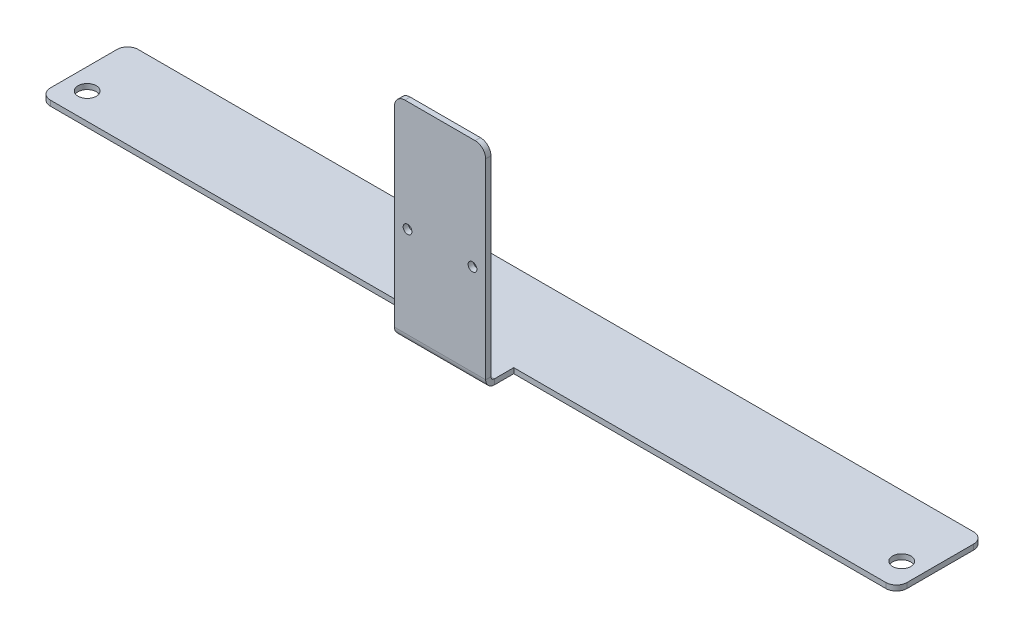
ISO-10303-21;
HEADER;
FILE_DESCRIPTION(('STEP AP214'),'2;1');
FILE_NAME('part.step','',(''),(''),'','','');
FILE_SCHEMA(('AUTOMOTIVE_DESIGN { 1 0 10303 214 1 1 1 1 }'));
ENDSEC;
DATA;
#1=APPLICATION_CONTEXT('core data for automotive mechanical design processes');
#2=APPLICATION_PROTOCOL_DEFINITION('international standard','automotive_design',2000,#1);
#3=PRODUCT_CONTEXT('',#1,'mechanical');
#4=PRODUCT('Part','Part','',(#3));
#5=PRODUCT_RELATED_PRODUCT_CATEGORY('part','',(#4));
#6=PRODUCT_DEFINITION_FORMATION('','',#4);
#7=PRODUCT_DEFINITION_CONTEXT('part definition',#1,'design');
#8=PRODUCT_DEFINITION('design','',#6,#7);
#9=PRODUCT_DEFINITION_SHAPE('','',#8);
#10=(LENGTH_UNIT() NAMED_UNIT(*) SI_UNIT(.MILLI.,.METRE.));
#11=(NAMED_UNIT(*) PLANE_ANGLE_UNIT() SI_UNIT($,.RADIAN.));
#12=(NAMED_UNIT(*) SI_UNIT($,.STERADIAN.) SOLID_ANGLE_UNIT());
#13=UNCERTAINTY_MEASURE_WITH_UNIT(LENGTH_MEASURE(1.E-05),#10,'distance_accuracy_value','');
#14=(GEOMETRIC_REPRESENTATION_CONTEXT(3) GLOBAL_UNCERTAINTY_ASSIGNED_CONTEXT((#13)) GLOBAL_UNIT_ASSIGNED_CONTEXT((#10,
#11,#12)) REPRESENTATION_CONTEXT('',''));
#15=CARTESIAN_POINT('',(0.,0.,0.));
#16=DIRECTION('',(0.,0.,1.));
#17=DIRECTION('',(1.,0.,0.));
#18=AXIS2_PLACEMENT_3D('',#15,#16,#17);
#19=CARTESIAN_POINT('',(-122.,-1.5,12.5));
#20=DIRECTION('',(0.,0.,1.));
#21=DIRECTION('',(1.,0.,0.));
#22=AXIS2_PLACEMENT_3D('',#19,#20,#21);
#23=PLANE('',#22);
#24=DIRECTION('',(1.,0.,0.));
#25=VECTOR('',#24,1.);
#26=CARTESIAN_POINT('',(-122.,-1.5,12.5));
#27=LINE('',#26,#25);
#28=CARTESIAN_POINT('',(12.9999999999999,-1.5,12.5));
#29=VERTEX_POINT('',#28);
#30=CARTESIAN_POINT('',(119.,-1.5,12.5));
#31=VERTEX_POINT('',#30);
#32=EDGE_CURVE('E279',#29,#31,#27,.T.);
#33=ORIENTED_EDGE('',*,*,#32,.T.);
#34=DIRECTION('',(0.,1.,0.));
#35=VECTOR('',#34,1.);
#36=CARTESIAN_POINT('',(119.,-1.5,12.5));
#37=LINE('',#36,#35);
#38=CARTESIAN_POINT('',(119.,0.,12.5));
#39=VERTEX_POINT('',#38);
#40=EDGE_CURVE('E304',#31,#39,#37,.T.);
#41=ORIENTED_EDGE('',*,*,#40,.T.);
#42=DIRECTION('',(1.,0.,0.));
#43=VECTOR('',#42,1.);
#44=CARTESIAN_POINT('',(-122.,0.,12.5));
#45=LINE('',#44,#43);
#46=CARTESIAN_POINT('',(13.,0.,12.5));
#47=VERTEX_POINT('',#46);
#48=EDGE_CURVE('E269',#47,#39,#45,.T.);
#49=ORIENTED_EDGE('',*,*,#48,.F.);
#50=DIRECTION('',(0.,-1.,0.));
#51=VECTOR('',#50,1.);
#52=CARTESIAN_POINT('',(13.,0.,12.5));
#53=LINE('',#52,#51);
#54=EDGE_CURVE('E248',#47,#29,#53,.T.);
#55=ORIENTED_EDGE('',*,*,#54,.T.);
#56=EDGE_LOOP('',(#33,#41,#49,#55));
#57=FACE_BOUND('',#56,.T.);
#58=ADVANCED_FACE('F58',(#57),#23,.T.);
#59=CARTESIAN_POINT('',(122.,-1.5,12.5));
#60=DIRECTION('',(1.,0.,0.));
#61=DIRECTION('',(0.,0.,-1.));
#62=AXIS2_PLACEMENT_3D('',#59,#60,#61);
#63=PLANE('',#62);
#64=DIRECTION('',(0.,0.,-1.));
#65=VECTOR('',#64,1.);
#66=CARTESIAN_POINT('',(122.,-1.5,12.5));
#67=LINE('',#66,#65);
#68=CARTESIAN_POINT('',(122.,-1.5,9.5));
#69=VERTEX_POINT('',#68);
#70=CARTESIAN_POINT('',(122.,-1.5,-9.5));
#71=VERTEX_POINT('',#70);
#72=EDGE_CURVE('E268',#69,#71,#67,.T.);
#73=ORIENTED_EDGE('',*,*,#72,.T.);
#74=DIRECTION('',(0.,1.,0.));
#75=VECTOR('',#74,1.);
#76=CARTESIAN_POINT('',(122.,-1.5,-9.5));
#77=LINE('',#76,#75);
#78=CARTESIAN_POINT('',(122.,0.,-9.5));
#79=VERTEX_POINT('',#78);
#80=EDGE_CURVE('E260',#71,#79,#77,.T.);
#81=ORIENTED_EDGE('',*,*,#80,.T.);
#82=DIRECTION('',(0.,0.,-1.));
#83=VECTOR('',#82,1.);
#84=CARTESIAN_POINT('',(122.,0.,12.5));
#85=LINE('',#84,#83);
#86=CARTESIAN_POINT('',(122.,0.,9.5));
#87=VERTEX_POINT('',#86);
#88=EDGE_CURVE('E289',#87,#79,#85,.T.);
#89=ORIENTED_EDGE('',*,*,#88,.F.);
#90=DIRECTION('',(0.,1.,0.));
#91=VECTOR('',#90,1.);
#92=CARTESIAN_POINT('',(122.,-1.5,9.5));
#93=LINE('',#92,#91);
#94=EDGE_CURVE('E258',#87,#69,#93,.F.);
#95=ORIENTED_EDGE('',*,*,#94,.T.);
#96=EDGE_LOOP('',(#73,#81,#89,#95));
#97=FACE_BOUND('',#96,.T.);
#98=ADVANCED_FACE('F377',(#97),#63,.T.);
#99=CARTESIAN_POINT('',(-119.,0.,12.5));
#100=VERTEX_POINT('',#99);
#101=CARTESIAN_POINT('',(-13.,0.,12.5));
#102=VERTEX_POINT('',#101);
#103=EDGE_CURVE('E265',#100,#102,#45,.T.);
#104=ORIENTED_EDGE('',*,*,#103,.F.);
#105=DIRECTION('',(0.,1.,0.));
#106=VECTOR('',#105,1.);
#107=CARTESIAN_POINT('',(-119.,-1.5,12.5));
#108=LINE('',#107,#106);
#109=CARTESIAN_POINT('',(-119.,-1.5,12.5));
#110=VERTEX_POINT('',#109);
#111=EDGE_CURVE('E13',#100,#110,#108,.F.);
#112=ORIENTED_EDGE('',*,*,#111,.T.);
#113=CARTESIAN_POINT('',(-13.,-1.5,12.5));
#114=VERTEX_POINT('',#113);
#115=EDGE_CURVE('E261',#110,#114,#27,.T.);
#116=ORIENTED_EDGE('',*,*,#115,.T.);
#117=DIRECTION('',(0.,-1.,0.));
#118=VECTOR('',#117,1.);
#119=CARTESIAN_POINT('',(-13.,0.,12.5));
#120=LINE('',#119,#118);
#121=EDGE_CURVE('E237',#102,#114,#120,.T.);
#122=ORIENTED_EDGE('',*,*,#121,.F.);
#123=EDGE_LOOP('',(#104,#112,#116,#122));
#124=FACE_BOUND('',#123,.T.);
#125=ADVANCED_FACE('F401',(#124),#23,.T.);
#126=CARTESIAN_POINT('',(-122.,-1.5,12.5));
#127=DIRECTION('',(-1.,0.,0.));
#128=DIRECTION('',(0.,0.,1.));
#129=AXIS2_PLACEMENT_3D('',#126,#127,#128);
#130=PLANE('',#129);
#131=DIRECTION('',(0.,0.,1.));
#132=VECTOR('',#131,1.);
#133=CARTESIAN_POINT('',(-122.,-1.5,12.5));
#134=LINE('',#133,#132);
#135=CARTESIAN_POINT('',(-122.,-1.5,-9.5));
#136=VERTEX_POINT('',#135);
#137=CARTESIAN_POINT('',(-122.,-1.5,9.5));
#138=VERTEX_POINT('',#137);
#139=EDGE_CURVE('E283',#136,#138,#134,.T.);
#140=ORIENTED_EDGE('',*,*,#139,.T.);
#141=DIRECTION('',(0.,1.,0.));
#142=VECTOR('',#141,1.);
#143=CARTESIAN_POINT('',(-122.,-1.5,9.5));
#144=LINE('',#143,#142);
#145=CARTESIAN_POINT('',(-122.,0.,9.5));
#146=VERTEX_POINT('',#145);
#147=EDGE_CURVE('E66',#138,#146,#144,.T.);
#148=ORIENTED_EDGE('',*,*,#147,.T.);
#149=DIRECTION('',(0.,0.,1.));
#150=VECTOR('',#149,1.);
#151=CARTESIAN_POINT('',(-122.,0.,12.5));
#152=LINE('',#151,#150);
#153=CARTESIAN_POINT('',(-122.,0.,-9.5));
#154=VERTEX_POINT('',#153);
#155=EDGE_CURVE('E274',#154,#146,#152,.T.);
#156=ORIENTED_EDGE('',*,*,#155,.F.);
#157=DIRECTION('',(0.,1.,0.));
#158=VECTOR('',#157,1.);
#159=CARTESIAN_POINT('',(-122.,-1.5,-9.5));
#160=LINE('',#159,#158);
#161=EDGE_CURVE('E323',#154,#136,#160,.F.);
#162=ORIENTED_EDGE('',*,*,#161,.T.);
#163=EDGE_LOOP('',(#140,#148,#156,#162));
#164=FACE_BOUND('',#163,.T.);
#165=ADVANCED_FACE('F330',(#164),#130,.T.);
#166=CARTESIAN_POINT('',(-122.,-1.5,-12.5));
#167=DIRECTION('',(0.,0.,-1.));
#168=DIRECTION('',(-1.,0.,0.));
#169=AXIS2_PLACEMENT_3D('',#166,#167,#168);
#170=PLANE('',#169);
#171=DIRECTION('',(-1.,0.,0.));
#172=VECTOR('',#171,1.);
#173=CARTESIAN_POINT('',(-122.,0.,-12.5));
#174=LINE('',#173,#172);
#175=CARTESIAN_POINT('',(119.,0.,-12.5));
#176=VERTEX_POINT('',#175);
#177=CARTESIAN_POINT('',(-119.,0.,-12.5));
#178=VERTEX_POINT('',#177);
#179=EDGE_CURVE('E341',#176,#178,#174,.T.);
#180=ORIENTED_EDGE('',*,*,#179,.F.);
#181=DIRECTION('',(0.,1.,0.));
#182=VECTOR('',#181,1.);
#183=CARTESIAN_POINT('',(119.,-1.5,-12.5));
#184=LINE('',#183,#182);
#185=CARTESIAN_POINT('',(119.,-1.5,-12.5));
#186=VERTEX_POINT('',#185);
#187=EDGE_CURVE('E294',#176,#186,#184,.F.);
#188=ORIENTED_EDGE('',*,*,#187,.T.);
#189=DIRECTION('',(-1.,0.,0.));
#190=VECTOR('',#189,1.);
#191=CARTESIAN_POINT('',(-122.,-1.5,-12.5));
#192=LINE('',#191,#190);
#193=CARTESIAN_POINT('',(-119.,-1.5,-12.5));
#194=VERTEX_POINT('',#193);
#195=EDGE_CURVE('E390',#186,#194,#192,.T.);
#196=ORIENTED_EDGE('',*,*,#195,.T.);
#197=DIRECTION('',(0.,1.,0.));
#198=VECTOR('',#197,1.);
#199=CARTESIAN_POINT('',(-119.,-1.5,-12.5));
#200=LINE('',#199,#198);
#201=EDGE_CURVE('E383',#194,#178,#200,.T.);
#202=ORIENTED_EDGE('',*,*,#201,.T.);
#203=EDGE_LOOP('',(#180,#188,#196,#202));
#204=FACE_BOUND('',#203,.T.);
#205=ADVANCED_FACE('F389',(#204),#170,.T.);
#206=CARTESIAN_POINT('',(0.,-1.5,0.));
#207=DIRECTION('',(0.,-1.,0.));
#208=DIRECTION('',(0.,0.,-1.));
#209=AXIS2_PLACEMENT_3D('',#206,#207,#208);
#210=PLANE('',#209);
#211=CARTESIAN_POINT('',(-116.,-1.5,5.));
#212=DIRECTION('',(0.,-1.,0.));
#213=DIRECTION('',(0.,0.,-1.));
#214=AXIS2_PLACEMENT_3D('',#211,#212,#213);
#215=CIRCLE('',#214,2.6);
#216=CARTESIAN_POINT('',(-116.,-1.5,2.4));
#217=VERTEX_POINT('',#216);
#218=EDGE_CURVE('E523',#217,#217,#215,.T.);
#219=ORIENTED_EDGE('',*,*,#218,.F.);
#220=EDGE_LOOP('',(#219));
#221=FACE_BOUND('',#220,.T.);
#222=CARTESIAN_POINT('',(116.,-1.5,5.00000000000003));
#223=DIRECTION('',(0.,-1.,0.));
#224=DIRECTION('',(0.,0.,-1.));
#225=AXIS2_PLACEMENT_3D('',#222,#223,#224);
#226=CIRCLE('',#225,2.6);
#227=CARTESIAN_POINT('',(116.,-1.5,2.40000000000003));
#228=VERTEX_POINT('',#227);
#229=EDGE_CURVE('E443',#228,#228,#226,.T.);
#230=ORIENTED_EDGE('',*,*,#229,.F.);
#231=EDGE_LOOP('',(#230));
#232=FACE_BOUND('',#231,.T.);
#233=ORIENTED_EDGE('',*,*,#195,.F.);
#234=CARTESIAN_POINT('',(119.,-1.5,-9.5));
#235=DIRECTION('',(0.,-1.,0.));
#236=DIRECTION('',(0.,0.,-1.));
#237=AXIS2_PLACEMENT_3D('',#234,#235,#236);
#238=CIRCLE('',#237,3.);
#239=EDGE_CURVE('E302',#186,#71,#238,.T.);
#240=ORIENTED_EDGE('',*,*,#239,.T.);
#241=ORIENTED_EDGE('',*,*,#72,.F.);
#242=CARTESIAN_POINT('',(119.,-1.5,9.5));
#243=DIRECTION('',(0.,-1.,0.));
#244=DIRECTION('',(0.,0.,-1.));
#245=AXIS2_PLACEMENT_3D('',#242,#243,#244);
#246=CIRCLE('',#245,3.);
#247=EDGE_CURVE('E300',#69,#31,#246,.T.);
#248=ORIENTED_EDGE('',*,*,#247,.T.);
#249=ORIENTED_EDGE('',*,*,#32,.F.);
#250=DIRECTION('',(0.,0.,-1.));
#251=VECTOR('',#250,1.);
#252=CARTESIAN_POINT('',(13.,-1.5,18.));
#253=LINE('',#252,#251);
#254=CARTESIAN_POINT('',(13.,-1.5,18.));
#255=VERTEX_POINT('',#254);
#256=EDGE_CURVE('E254',#255,#29,#253,.T.);
#257=ORIENTED_EDGE('',*,*,#256,.F.);
#258=DIRECTION('',(1.,0.,0.));
#259=VECTOR('',#258,1.);
#260=CARTESIAN_POINT('',(13.,-1.5,18.));
#261=LINE('',#260,#259);
#262=CARTESIAN_POINT('',(-13.,-1.5,18.));
#263=VERTEX_POINT('',#262);
#264=EDGE_CURVE('E200',#255,#263,#261,.F.);
#265=ORIENTED_EDGE('',*,*,#264,.T.);
#266=DIRECTION('',(0.,0.,-1.));
#267=VECTOR('',#266,1.);
#268=CARTESIAN_POINT('',(-13.,-1.5,18.));
#269=LINE('',#268,#267);
#270=EDGE_CURVE('E251',#263,#114,#269,.T.);
#271=ORIENTED_EDGE('',*,*,#270,.T.);
#272=ORIENTED_EDGE('',*,*,#115,.F.);
#273=CARTESIAN_POINT('',(-119.,-1.5,9.5));
#274=DIRECTION('',(0.,-1.,0.));
#275=DIRECTION('',(0.,0.,-1.));
#276=AXIS2_PLACEMENT_3D('',#273,#274,#275);
#277=CIRCLE('',#276,3.);
#278=EDGE_CURVE('E298',#110,#138,#277,.T.);
#279=ORIENTED_EDGE('',*,*,#278,.T.);
#280=ORIENTED_EDGE('',*,*,#139,.F.);
#281=CARTESIAN_POINT('',(-119.,-1.5,-9.5));
#282=DIRECTION('',(0.,-1.,0.));
#283=DIRECTION('',(0.,0.,-1.));
#284=AXIS2_PLACEMENT_3D('',#281,#282,#283);
#285=CIRCLE('',#284,3.);
#286=EDGE_CURVE('E296',#136,#194,#285,.T.);
#287=ORIENTED_EDGE('',*,*,#286,.T.);
#288=EDGE_LOOP('',(#233,#240,#241,#248,#249,#257,#265,#271,#272,#279,#280,#287));
#289=FACE_BOUND('',#288,.T.);
#290=ADVANCED_FACE('F366',(#221,#232,#289),#210,.T.);
#291=CARTESIAN_POINT('',(0.,0.,0.));
#292=DIRECTION('',(0.,-1.,0.));
#293=DIRECTION('',(0.,0.,-1.));
#294=AXIS2_PLACEMENT_3D('',#291,#292,#293);
#295=PLANE('',#294);
#296=CARTESIAN_POINT('',(-116.,0.,5.));
#297=DIRECTION('',(0.,-1.,0.));
#298=DIRECTION('',(0.,0.,-1.));
#299=AXIS2_PLACEMENT_3D('',#296,#297,#298);
#300=CIRCLE('',#299,2.6);
#301=CARTESIAN_POINT('',(-116.,0.,2.4));
#302=VERTEX_POINT('',#301);
#303=EDGE_CURVE('E439',#302,#302,#300,.T.);
#304=ORIENTED_EDGE('',*,*,#303,.T.);
#305=EDGE_LOOP('',(#304));
#306=FACE_BOUND('',#305,.T.);
#307=CARTESIAN_POINT('',(116.,0.,5.00000000000003));
#308=DIRECTION('',(0.,-1.,0.));
#309=DIRECTION('',(0.,0.,-1.));
#310=AXIS2_PLACEMENT_3D('',#307,#308,#309);
#311=CIRCLE('',#310,2.6);
#312=CARTESIAN_POINT('',(116.,0.,2.40000000000003));
#313=VERTEX_POINT('',#312);
#314=EDGE_CURVE('E224',#313,#313,#311,.T.);
#315=ORIENTED_EDGE('',*,*,#314,.T.);
#316=EDGE_LOOP('',(#315));
#317=FACE_BOUND('',#316,.T.);
#318=ORIENTED_EDGE('',*,*,#88,.T.);
#319=CARTESIAN_POINT('',(119.,0.,-9.5));
#320=DIRECTION('',(0.,-1.,0.));
#321=DIRECTION('',(0.,0.,-1.));
#322=AXIS2_PLACEMENT_3D('',#319,#320,#321);
#323=CIRCLE('',#322,3.);
#324=EDGE_CURVE('E374',#79,#176,#323,.F.);
#325=ORIENTED_EDGE('',*,*,#324,.T.);
#326=ORIENTED_EDGE('',*,*,#179,.T.);
#327=CARTESIAN_POINT('',(-119.,0.,-9.5));
#328=DIRECTION('',(0.,-1.,0.));
#329=DIRECTION('',(0.,0.,-1.));
#330=AXIS2_PLACEMENT_3D('',#327,#328,#329);
#331=CIRCLE('',#330,3.);
#332=EDGE_CURVE('E264',#178,#154,#331,.F.);
#333=ORIENTED_EDGE('',*,*,#332,.T.);
#334=ORIENTED_EDGE('',*,*,#155,.T.);
#335=CARTESIAN_POINT('',(-119.,0.,9.5));
#336=DIRECTION('',(0.,-1.,0.));
#337=DIRECTION('',(0.,0.,-1.));
#338=AXIS2_PLACEMENT_3D('',#335,#336,#337);
#339=CIRCLE('',#338,3.);
#340=EDGE_CURVE('E338',#146,#100,#339,.F.);
#341=ORIENTED_EDGE('',*,*,#340,.T.);
#342=ORIENTED_EDGE('',*,*,#103,.T.);
#343=DIRECTION('',(0.,0.,-1.));
#344=VECTOR('',#343,1.);
#345=CARTESIAN_POINT('',(-13.,0.,18.));
#346=LINE('',#345,#344);
#347=CARTESIAN_POINT('',(-13.,0.,18.));
#348=VERTEX_POINT('',#347);
#349=EDGE_CURVE('E255',#348,#102,#346,.T.);
#350=ORIENTED_EDGE('',*,*,#349,.F.);
#351=DIRECTION('',(1.,0.,0.));
#352=VECTOR('',#351,1.);
#353=CARTESIAN_POINT('',(13.,0.,18.));
#354=LINE('',#353,#352);
#355=CARTESIAN_POINT('',(13.,0.,18.));
#356=VERTEX_POINT('',#355);
#357=EDGE_CURVE('E231',#356,#348,#354,.F.);
#358=ORIENTED_EDGE('',*,*,#357,.F.);
#359=DIRECTION('',(0.,0.,-1.));
#360=VECTOR('',#359,1.);
#361=CARTESIAN_POINT('',(13.,0.,18.));
#362=LINE('',#361,#360);
#363=EDGE_CURVE('E343',#356,#47,#362,.T.);
#364=ORIENTED_EDGE('',*,*,#363,.T.);
#365=ORIENTED_EDGE('',*,*,#48,.T.);
#366=CARTESIAN_POINT('',(119.,0.,9.5));
#367=DIRECTION('',(0.,-1.,0.));
#368=DIRECTION('',(0.,0.,-1.));
#369=AXIS2_PLACEMENT_3D('',#366,#367,#368);
#370=CIRCLE('',#369,3.);
#371=EDGE_CURVE('E373',#39,#87,#370,.F.);
#372=ORIENTED_EDGE('',*,*,#371,.T.);
#373=EDGE_LOOP('',(#318,#325,#326,#333,#334,#341,#342,#350,#358,#364,#365,#372));
#374=FACE_BOUND('',#373,.T.);
#375=ADVANCED_FACE('F337',(#306,#317,#374),#295,.F.);
#376=CARTESIAN_POINT('',(13.,0.,18.));
#377=DIRECTION('',(1.,0.,0.));
#378=DIRECTION('',(0.,-1.,0.));
#379=AXIS2_PLACEMENT_3D('',#376,#377,#378);
#380=PLANE('',#379);
#381=ORIENTED_EDGE('',*,*,#363,.F.);
#382=DIRECTION('',(0.,-1.,0.));
#383=VECTOR('',#382,1.);
#384=CARTESIAN_POINT('',(13.,0.,18.));
#385=LINE('',#384,#383);
#386=EDGE_CURVE('E227',#356,#255,#385,.T.);
#387=ORIENTED_EDGE('',*,*,#386,.T.);
#388=ORIENTED_EDGE('',*,*,#256,.T.);
#389=ORIENTED_EDGE('',*,*,#54,.F.);
#390=EDGE_LOOP('',(#381,#387,#388,#389));
#391=FACE_BOUND('',#390,.T.);
#392=ADVANCED_FACE('F419',(#391),#380,.T.);
#393=CARTESIAN_POINT('',(-13.,0.,18.));
#394=DIRECTION('',(1.,0.,0.));
#395=DIRECTION('',(0.,-1.,0.));
#396=AXIS2_PLACEMENT_3D('',#393,#394,#395);
#397=PLANE('',#396);
#398=ORIENTED_EDGE('',*,*,#270,.F.);
#399=DIRECTION('',(0.,-1.,0.));
#400=VECTOR('',#399,1.);
#401=CARTESIAN_POINT('',(-13.,0.,18.));
#402=LINE('',#401,#400);
#403=EDGE_CURVE('E234',#348,#263,#402,.T.);
#404=ORIENTED_EDGE('',*,*,#403,.F.);
#405=ORIENTED_EDGE('',*,*,#349,.T.);
#406=ORIENTED_EDGE('',*,*,#121,.T.);
#407=EDGE_LOOP('',(#398,#404,#405,#406));
#408=FACE_BOUND('',#407,.T.);
#409=ADVANCED_FACE('F416',(#408),#397,.F.);
#410=CARTESIAN_POINT('',(-13.,1.,18.));
#411=DIRECTION('',(-1.,0.,0.));
#412=DIRECTION('',(0.,-1.,0.));
#413=AXIS2_PLACEMENT_3D('',#410,#411,#412);
#414=PLANE('',#413);
#415=DIRECTION('',(0.,0.,1.));
#416=VECTOR('',#415,1.);
#417=CARTESIAN_POINT('',(-13.,1.,20.5000000000002));
#418=LINE('',#417,#416);
#419=CARTESIAN_POINT('',(-13.,0.999999999999999,19.));
#420=VERTEX_POINT('',#419);
#421=CARTESIAN_POINT('',(-13.,0.999999999999993,20.5));
#422=VERTEX_POINT('',#421);
#423=EDGE_CURVE('E221',#420,#422,#418,.T.);
#424=ORIENTED_EDGE('',*,*,#423,.F.);
#425=CARTESIAN_POINT('',(-13.,1.,18.));
#426=DIRECTION('',(1.,0.,0.));
#427=DIRECTION('',(0.,1.,0.));
#428=AXIS2_PLACEMENT_3D('',#425,#426,#427);
#429=CIRCLE('',#428,1.);
#430=EDGE_CURVE('E203',#348,#420,#429,.F.);
#431=ORIENTED_EDGE('',*,*,#430,.F.);
#432=ORIENTED_EDGE('',*,*,#403,.T.);
#433=CARTESIAN_POINT('',(-13.,1.,18.));
#434=DIRECTION('',(1.,0.,0.));
#435=DIRECTION('',(0.,1.,0.));
#436=AXIS2_PLACEMENT_3D('',#433,#434,#435);
#437=CIRCLE('',#436,2.5);
#438=EDGE_CURVE('E226',#263,#422,#437,.F.);
#439=ORIENTED_EDGE('',*,*,#438,.T.);
#440=EDGE_LOOP('',(#424,#431,#432,#439));
#441=FACE_BOUND('',#440,.T.);
#442=ADVANCED_FACE('F418',(#441),#414,.T.);
#443=CARTESIAN_POINT('',(13.,0.999999999999996,18.));
#444=DIRECTION('',(-1.,0.,0.));
#445=DIRECTION('',(0.,-1.,0.));
#446=AXIS2_PLACEMENT_3D('',#443,#444,#445);
#447=PLANE('',#446);
#448=CARTESIAN_POINT('',(13.,0.999999999999996,18.));
#449=DIRECTION('',(1.,0.,0.));
#450=DIRECTION('',(0.,1.,0.));
#451=AXIS2_PLACEMENT_3D('',#448,#449,#450);
#452=CIRCLE('',#451,1.);
#453=CARTESIAN_POINT('',(13.,0.999999999999993,19.));
#454=VERTEX_POINT('',#453);
#455=EDGE_CURVE('E190',#454,#356,#452,.T.);
#456=ORIENTED_EDGE('',*,*,#455,.F.);
#457=DIRECTION('',(0.,0.,1.));
#458=VECTOR('',#457,1.);
#459=CARTESIAN_POINT('',(13.,0.999999999999997,19.));
#460=LINE('',#459,#458);
#461=CARTESIAN_POINT('',(13.,0.999999999999997,20.5));
#462=VERTEX_POINT('',#461);
#463=EDGE_CURVE('E187',#454,#462,#460,.T.);
#464=ORIENTED_EDGE('',*,*,#463,.T.);
#465=CARTESIAN_POINT('',(13.,0.999999999999996,18.));
#466=DIRECTION('',(1.,0.,0.));
#467=DIRECTION('',(0.,1.,0.));
#468=AXIS2_PLACEMENT_3D('',#465,#466,#467);
#469=CIRCLE('',#468,2.5);
#470=EDGE_CURVE('E195',#462,#255,#469,.T.);
#471=ORIENTED_EDGE('',*,*,#470,.T.);
#472=ORIENTED_EDGE('',*,*,#386,.F.);
#473=EDGE_LOOP('',(#456,#464,#471,#472));
#474=FACE_BOUND('',#473,.T.);
#475=ADVANCED_FACE('F206',(#474),#447,.F.);
#476=CARTESIAN_POINT('',(13.,0.999999999999996,18.));
#477=DIRECTION('',(1.,0.,0.));
#478=DIRECTION('',(0.,0.,1.));
#479=AXIS2_PLACEMENT_3D('',#476,#477,#478);
#480=CYLINDRICAL_SURFACE('',#479,2.5);
#481=ORIENTED_EDGE('',*,*,#264,.F.);
#482=ORIENTED_EDGE('',*,*,#470,.F.);
#483=DIRECTION('',(1.,0.,0.));
#484=VECTOR('',#483,1.);
#485=CARTESIAN_POINT('',(0.,0.999999999999999,20.5));
#486=LINE('',#485,#484);
#487=EDGE_CURVE('E197',#422,#462,#486,.T.);
#488=ORIENTED_EDGE('',*,*,#487,.F.);
#489=ORIENTED_EDGE('',*,*,#438,.F.);
#490=EDGE_LOOP('',(#481,#482,#488,#489));
#491=FACE_BOUND('',#490,.T.);
#492=ADVANCED_FACE('F196',(#491),#480,.T.);
#493=CARTESIAN_POINT('',(13.,0.999999999999996,18.));
#494=DIRECTION('',(1.,0.,0.));
#495=DIRECTION('',(0.,0.,1.));
#496=AXIS2_PLACEMENT_3D('',#493,#494,#495);
#497=CYLINDRICAL_SURFACE('',#496,1.);
#498=ORIENTED_EDGE('',*,*,#357,.T.);
#499=ORIENTED_EDGE('',*,*,#430,.T.);
#500=DIRECTION('',(-1.,0.,0.));
#501=VECTOR('',#500,1.);
#502=CARTESIAN_POINT('',(-13.,1.,19.));
#503=LINE('',#502,#501);
#504=EDGE_CURVE('E208',#420,#454,#503,.F.);
#505=ORIENTED_EDGE('',*,*,#504,.T.);
#506=ORIENTED_EDGE('',*,*,#455,.T.);
#507=EDGE_LOOP('',(#498,#499,#505,#506));
#508=FACE_BOUND('',#507,.T.);
#509=ADVANCED_FACE('F468',(#508),#497,.F.);
#510=CARTESIAN_POINT('',(13.,0.,20.5));
#511=DIRECTION('',(1.,0.,0.));
#512=DIRECTION('',(0.,0.,-1.));
#513=AXIS2_PLACEMENT_3D('',#510,#511,#512);
#514=PLANE('',#513);
#515=DIRECTION('',(0.,1.,0.));
#516=VECTOR('',#515,1.);
#517=CARTESIAN_POINT('',(13.,0.,19.));
#518=LINE('',#517,#516);
#519=CARTESIAN_POINT('',(13.,55.5,19.0000000000002));
#520=VERTEX_POINT('',#519);
#521=EDGE_CURVE('E452',#520,#454,#518,.F.);
#522=ORIENTED_EDGE('',*,*,#521,.F.);
#523=DIRECTION('',(0.,0.,-1.));
#524=VECTOR('',#523,1.);
#525=CARTESIAN_POINT('',(13.,55.5,20.5000000000002));
#526=LINE('',#525,#524);
#527=CARTESIAN_POINT('',(13.,55.5,20.5000000000002));
#528=VERTEX_POINT('',#527);
#529=EDGE_CURVE('E81',#520,#528,#526,.F.);
#530=ORIENTED_EDGE('',*,*,#529,.T.);
#531=DIRECTION('',(0.,-1.,0.));
#532=VECTOR('',#531,1.);
#533=CARTESIAN_POINT('',(13.,0.,20.5));
#534=LINE('',#533,#532);
#535=EDGE_CURVE('E183',#528,#462,#534,.T.);
#536=ORIENTED_EDGE('',*,*,#535,.T.);
#537=ORIENTED_EDGE('',*,*,#463,.F.);
#538=EDGE_LOOP('',(#522,#530,#536,#537));
#539=FACE_BOUND('',#538,.T.);
#540=ADVANCED_FACE('F185',(#539),#514,.T.);
#541=CARTESIAN_POINT('',(-13.,58.5,20.5000000000002));
#542=DIRECTION('',(-1.,0.,0.));
#543=DIRECTION('',(0.,-1.,0.));
#544=AXIS2_PLACEMENT_3D('',#541,#542,#543);
#545=PLANE('',#544);
#546=DIRECTION('',(0.,1.,0.));
#547=VECTOR('',#546,1.);
#548=CARTESIAN_POINT('',(-13.,58.5,20.5000000000002));
#549=LINE('',#548,#547);
#550=CARTESIAN_POINT('',(-13.,55.5,20.5000000000002));
#551=VERTEX_POINT('',#550);
#552=EDGE_CURVE('E211',#422,#551,#549,.T.);
#553=ORIENTED_EDGE('',*,*,#552,.T.);
#554=DIRECTION('',(0.,0.,-1.));
#555=VECTOR('',#554,1.);
#556=CARTESIAN_POINT('',(-13.,55.5,20.5000000000002));
#557=LINE('',#556,#555);
#558=CARTESIAN_POINT('',(-13.,55.5,19.0000000000002));
#559=VERTEX_POINT('',#558);
#560=EDGE_CURVE('E320',#551,#559,#557,.T.);
#561=ORIENTED_EDGE('',*,*,#560,.T.);
#562=DIRECTION('',(0.,-1.,0.));
#563=VECTOR('',#562,1.);
#564=CARTESIAN_POINT('',(-13.,0.,19.));
#565=LINE('',#564,#563);
#566=EDGE_CURVE('E212',#420,#559,#565,.F.);
#567=ORIENTED_EDGE('',*,*,#566,.F.);
#568=ORIENTED_EDGE('',*,*,#423,.T.);
#569=EDGE_LOOP('',(#553,#561,#567,#568));
#570=FACE_BOUND('',#569,.T.);
#571=ADVANCED_FACE('F465',(#570),#545,.T.);
#572=CARTESIAN_POINT('',(0.,0.,20.5));
#573=DIRECTION('',(0.,0.,1.));
#574=DIRECTION('',(0.,-1.,0.));
#575=AXIS2_PLACEMENT_3D('',#572,#573,#574);
#576=PLANE('',#575);
#577=CARTESIAN_POINT('',(-9.25,27.,20.5));
#578=DIRECTION('',(0.,0.,1.));
#579=DIRECTION('',(1.,0.,0.));
#580=AXIS2_PLACEMENT_3D('',#577,#578,#579);
#581=CIRCLE('',#580,1.25);
#582=CARTESIAN_POINT('',(-8.,27.,20.5));
#583=VERTEX_POINT('',#582);
#584=EDGE_CURVE('E513',#583,#583,#581,.T.);
#585=ORIENTED_EDGE('',*,*,#584,.F.);
#586=EDGE_LOOP('',(#585));
#587=FACE_BOUND('',#586,.T.);
#588=CARTESIAN_POINT('',(9.25,27.,20.5));
#589=DIRECTION('',(0.,0.,1.));
#590=DIRECTION('',(1.,0.,0.));
#591=AXIS2_PLACEMENT_3D('',#588,#589,#590);
#592=CIRCLE('',#591,1.25);
#593=CARTESIAN_POINT('',(10.5,27.,20.5));
#594=VERTEX_POINT('',#593);
#595=EDGE_CURVE('E515',#594,#594,#592,.T.);
#596=ORIENTED_EDGE('',*,*,#595,.F.);
#597=EDGE_LOOP('',(#596));
#598=FACE_BOUND('',#597,.T.);
#599=ORIENTED_EDGE('',*,*,#535,.F.);
#600=CARTESIAN_POINT('',(10.,55.5,20.5000000000002));
#601=DIRECTION('',(0.,0.,1.));
#602=DIRECTION('',(0.,-1.,0.));
#603=AXIS2_PLACEMENT_3D('',#600,#601,#602);
#604=CIRCLE('',#603,3.);
#605=CARTESIAN_POINT('',(10.,58.5,20.5000000000002));
#606=VERTEX_POINT('',#605);
#607=EDGE_CURVE('E318',#528,#606,#604,.T.);
#608=ORIENTED_EDGE('',*,*,#607,.T.);
#609=DIRECTION('',(1.,0.,0.));
#610=VECTOR('',#609,1.);
#611=CARTESIAN_POINT('',(13.,58.5,20.5000000000002));
#612=LINE('',#611,#610);
#613=CARTESIAN_POINT('',(-9.99999999999999,58.5,20.5000000000002));
#614=VERTEX_POINT('',#613);
#615=EDGE_CURVE('E191',#614,#606,#612,.T.);
#616=ORIENTED_EDGE('',*,*,#615,.F.);
#617=CARTESIAN_POINT('',(-9.99999999999999,55.5,20.5000000000002));
#618=DIRECTION('',(0.,0.,1.));
#619=DIRECTION('',(0.,-1.,0.));
#620=AXIS2_PLACEMENT_3D('',#617,#618,#619);
#621=CIRCLE('',#620,3.);
#622=EDGE_CURVE('E73',#614,#551,#621,.T.);
#623=ORIENTED_EDGE('',*,*,#622,.T.);
#624=ORIENTED_EDGE('',*,*,#552,.F.);
#625=ORIENTED_EDGE('',*,*,#487,.T.);
#626=EDGE_LOOP('',(#599,#608,#616,#623,#624,#625));
#627=FACE_BOUND('',#626,.T.);
#628=ADVANCED_FACE('F210',(#587,#598,#627),#576,.T.);
#629=CARTESIAN_POINT('',(0.,0.,19.));
#630=DIRECTION('',(0.,0.,1.));
#631=DIRECTION('',(0.,-1.,0.));
#632=AXIS2_PLACEMENT_3D('',#629,#630,#631);
#633=PLANE('',#632);
#634=CARTESIAN_POINT('',(-9.25,27.,19.0000000000001));
#635=DIRECTION('',(0.,0.,1.));
#636=DIRECTION('',(0.,-1.,0.));
#637=AXIS2_PLACEMENT_3D('',#634,#635,#636);
#638=CIRCLE('',#637,1.25);
#639=CARTESIAN_POINT('',(-9.25,25.75,19.0000000000001));
#640=VERTEX_POINT('',#639);
#641=EDGE_CURVE('E510',#640,#640,#638,.T.);
#642=ORIENTED_EDGE('',*,*,#641,.T.);
#643=EDGE_LOOP('',(#642));
#644=FACE_BOUND('',#643,.T.);
#645=CARTESIAN_POINT('',(9.25,27.,19.0000000000001));
#646=DIRECTION('',(0.,0.,1.));
#647=DIRECTION('',(0.,-1.,0.));
#648=AXIS2_PLACEMENT_3D('',#645,#646,#647);
#649=CIRCLE('',#648,1.25);
#650=CARTESIAN_POINT('',(9.25,25.75,19.0000000000001));
#651=VERTEX_POINT('',#650);
#652=EDGE_CURVE('E520',#651,#651,#649,.T.);
#653=ORIENTED_EDGE('',*,*,#652,.T.);
#654=EDGE_LOOP('',(#653));
#655=FACE_BOUND('',#654,.T.);
#656=DIRECTION('',(-1.,0.,0.));
#657=VECTOR('',#656,1.);
#658=CARTESIAN_POINT('',(0.,58.5,19.0000000000002));
#659=LINE('',#658,#657);
#660=CARTESIAN_POINT('',(-9.99999999999999,58.5,19.0000000000002));
#661=VERTEX_POINT('',#660);
#662=CARTESIAN_POINT('',(10.,58.5,19.0000000000002));
#663=VERTEX_POINT('',#662);
#664=EDGE_CURVE('E215',#661,#663,#659,.F.);
#665=ORIENTED_EDGE('',*,*,#664,.T.);
#666=CARTESIAN_POINT('',(10.,55.5,19.0000000000002));
#667=DIRECTION('',(0.,0.,1.));
#668=DIRECTION('',(0.,-1.,0.));
#669=AXIS2_PLACEMENT_3D('',#666,#667,#668);
#670=CIRCLE('',#669,3.);
#671=EDGE_CURVE('E314',#663,#520,#670,.F.);
#672=ORIENTED_EDGE('',*,*,#671,.T.);
#673=ORIENTED_EDGE('',*,*,#521,.T.);
#674=ORIENTED_EDGE('',*,*,#504,.F.);
#675=ORIENTED_EDGE('',*,*,#566,.T.);
#676=CARTESIAN_POINT('',(-9.99999999999999,55.5,19.0000000000002));
#677=DIRECTION('',(0.,0.,1.));
#678=DIRECTION('',(0.,-1.,0.));
#679=AXIS2_PLACEMENT_3D('',#676,#677,#678);
#680=CIRCLE('',#679,3.);
#681=EDGE_CURVE('E312',#559,#661,#680,.F.);
#682=ORIENTED_EDGE('',*,*,#681,.T.);
#683=EDGE_LOOP('',(#665,#672,#673,#674,#675,#682));
#684=FACE_BOUND('',#683,.T.);
#685=ADVANCED_FACE('F456',(#644,#655,#684),#633,.F.);
#686=CARTESIAN_POINT('',(13.,58.5,20.5000000000002));
#687=DIRECTION('',(0.,1.,0.));
#688=DIRECTION('',(0.,0.,1.));
#689=AXIS2_PLACEMENT_3D('',#686,#687,#688);
#690=PLANE('',#689);
#691=ORIENTED_EDGE('',*,*,#615,.T.);
#692=DIRECTION('',(0.,0.,-1.));
#693=VECTOR('',#692,1.);
#694=CARTESIAN_POINT('',(10.,58.5,20.5000000000002));
#695=LINE('',#694,#693);
#696=EDGE_CURVE('E309',#606,#663,#695,.T.);
#697=ORIENTED_EDGE('',*,*,#696,.T.);
#698=ORIENTED_EDGE('',*,*,#664,.F.);
#699=DIRECTION('',(0.,0.,-1.));
#700=VECTOR('',#699,1.);
#701=CARTESIAN_POINT('',(-9.99999999999999,58.5,20.5000000000002));
#702=LINE('',#701,#700);
#703=EDGE_CURVE('E307',#661,#614,#702,.F.);
#704=ORIENTED_EDGE('',*,*,#703,.T.);
#705=EDGE_LOOP('',(#691,#697,#698,#704));
#706=FACE_BOUND('',#705,.T.);
#707=ADVANCED_FACE('F459',(#706),#690,.T.);
#708=CARTESIAN_POINT('',(116.,-1.5,5.00000000000003));
#709=DIRECTION('',(0.,-1.,0.));
#710=DIRECTION('',(0.,0.,-1.));
#711=AXIS2_PLACEMENT_3D('',#708,#709,#710);
#712=CYLINDRICAL_SURFACE('',#711,2.6);
#713=ORIENTED_EDGE('',*,*,#314,.F.);
#714=EDGE_LOOP('',(#713));
#715=FACE_BOUND('',#714,.T.);
#716=ORIENTED_EDGE('',*,*,#229,.T.);
#717=EDGE_LOOP('',(#716));
#718=FACE_BOUND('',#717,.T.);
#719=ADVANCED_FACE('F482',(#715,#718),#712,.F.);
#720=CARTESIAN_POINT('',(-116.,-1.5,5.));
#721=DIRECTION('',(0.,-1.,0.));
#722=DIRECTION('',(0.,0.,-1.));
#723=AXIS2_PLACEMENT_3D('',#720,#721,#722);
#724=CYLINDRICAL_SURFACE('',#723,2.6);
#725=ORIENTED_EDGE('',*,*,#303,.F.);
#726=EDGE_LOOP('',(#725));
#727=FACE_BOUND('',#726,.T.);
#728=ORIENTED_EDGE('',*,*,#218,.T.);
#729=EDGE_LOOP('',(#728));
#730=FACE_BOUND('',#729,.T.);
#731=ADVANCED_FACE('F492',(#727,#730),#724,.F.);
#732=CARTESIAN_POINT('',(9.25,27.,20.5));
#733=DIRECTION('',(0.,0.,1.));
#734=DIRECTION('',(1.,0.,0.));
#735=AXIS2_PLACEMENT_3D('',#732,#733,#734);
#736=CYLINDRICAL_SURFACE('',#735,1.25);
#737=ORIENTED_EDGE('',*,*,#652,.F.);
#738=EDGE_LOOP('',(#737));
#739=FACE_BOUND('',#738,.T.);
#740=ORIENTED_EDGE('',*,*,#595,.T.);
#741=EDGE_LOOP('',(#740));
#742=FACE_BOUND('',#741,.T.);
#743=ADVANCED_FACE('F495',(#739,#742),#736,.F.);
#744=CARTESIAN_POINT('',(-9.25,27.,20.5));
#745=DIRECTION('',(0.,0.,1.));
#746=DIRECTION('',(1.,0.,0.));
#747=AXIS2_PLACEMENT_3D('',#744,#745,#746);
#748=CYLINDRICAL_SURFACE('',#747,1.25);
#749=ORIENTED_EDGE('',*,*,#641,.F.);
#750=EDGE_LOOP('',(#749));
#751=FACE_BOUND('',#750,.T.);
#752=ORIENTED_EDGE('',*,*,#584,.T.);
#753=EDGE_LOOP('',(#752));
#754=FACE_BOUND('',#753,.T.);
#755=ADVANCED_FACE('F499',(#751,#754),#748,.F.);
#756=CARTESIAN_POINT('',(119.,-1.5,-9.5));
#757=DIRECTION('',(0.,1.,0.));
#758=DIRECTION('',(0.,0.,1.));
#759=AXIS2_PLACEMENT_3D('',#756,#757,#758);
#760=CYLINDRICAL_SURFACE('',#759,3.);
#761=ORIENTED_EDGE('',*,*,#239,.F.);
#762=ORIENTED_EDGE('',*,*,#187,.F.);
#763=ORIENTED_EDGE('',*,*,#324,.F.);
#764=ORIENTED_EDGE('',*,*,#80,.F.);
#765=EDGE_LOOP('',(#761,#762,#763,#764));
#766=FACE_BOUND('',#765,.T.);
#767=ADVANCED_FACE('F381',(#766),#760,.T.);
#768=CARTESIAN_POINT('',(119.,-1.5,9.5));
#769=DIRECTION('',(0.,1.,0.));
#770=DIRECTION('',(0.,0.,1.));
#771=AXIS2_PLACEMENT_3D('',#768,#769,#770);
#772=CYLINDRICAL_SURFACE('',#771,3.);
#773=ORIENTED_EDGE('',*,*,#247,.F.);
#774=ORIENTED_EDGE('',*,*,#94,.F.);
#775=ORIENTED_EDGE('',*,*,#371,.F.);
#776=ORIENTED_EDGE('',*,*,#40,.F.);
#777=EDGE_LOOP('',(#773,#774,#775,#776));
#778=FACE_BOUND('',#777,.T.);
#779=ADVANCED_FACE('F372',(#778),#772,.T.);
#780=CARTESIAN_POINT('',(10.,55.5,20.5000000000002));
#781=DIRECTION('',(0.,0.,-1.));
#782=DIRECTION('',(0.,1.,0.));
#783=AXIS2_PLACEMENT_3D('',#780,#781,#782);
#784=CYLINDRICAL_SURFACE('',#783,3.);
#785=ORIENTED_EDGE('',*,*,#607,.F.);
#786=ORIENTED_EDGE('',*,*,#529,.F.);
#787=ORIENTED_EDGE('',*,*,#671,.F.);
#788=ORIENTED_EDGE('',*,*,#696,.F.);
#789=EDGE_LOOP('',(#785,#786,#787,#788));
#790=FACE_BOUND('',#789,.T.);
#791=ADVANCED_FACE('F538',(#790),#784,.T.);
#792=CARTESIAN_POINT('',(-9.99999999999999,55.5,20.5000000000002));
#793=DIRECTION('',(0.,0.,-1.));
#794=DIRECTION('',(0.,1.,0.));
#795=AXIS2_PLACEMENT_3D('',#792,#793,#794);
#796=CYLINDRICAL_SURFACE('',#795,3.);
#797=ORIENTED_EDGE('',*,*,#622,.F.);
#798=ORIENTED_EDGE('',*,*,#703,.F.);
#799=ORIENTED_EDGE('',*,*,#681,.F.);
#800=ORIENTED_EDGE('',*,*,#560,.F.);
#801=EDGE_LOOP('',(#797,#798,#799,#800));
#802=FACE_BOUND('',#801,.T.);
#803=ADVANCED_FACE('F398',(#802),#796,.T.);
#804=CARTESIAN_POINT('',(-119.,-1.5,9.5));
#805=DIRECTION('',(0.,1.,0.));
#806=DIRECTION('',(0.,0.,1.));
#807=AXIS2_PLACEMENT_3D('',#804,#805,#806);
#808=CYLINDRICAL_SURFACE('',#807,3.);
#809=ORIENTED_EDGE('',*,*,#278,.F.);
#810=ORIENTED_EDGE('',*,*,#111,.F.);
#811=ORIENTED_EDGE('',*,*,#340,.F.);
#812=ORIENTED_EDGE('',*,*,#147,.F.);
#813=EDGE_LOOP('',(#809,#810,#811,#812));
#814=FACE_BOUND('',#813,.T.);
#815=ADVANCED_FACE('F394',(#814),#808,.T.);
#816=CARTESIAN_POINT('',(-119.,-1.5,-9.5));
#817=DIRECTION('',(0.,1.,0.));
#818=DIRECTION('',(0.,0.,1.));
#819=AXIS2_PLACEMENT_3D('',#816,#817,#818);
#820=CYLINDRICAL_SURFACE('',#819,3.);
#821=ORIENTED_EDGE('',*,*,#286,.F.);
#822=ORIENTED_EDGE('',*,*,#161,.F.);
#823=ORIENTED_EDGE('',*,*,#332,.F.);
#824=ORIENTED_EDGE('',*,*,#201,.F.);
#825=EDGE_LOOP('',(#821,#822,#823,#824));
#826=FACE_BOUND('',#825,.T.);
#827=ADVANCED_FACE('F60',(#826),#820,.T.);
#828=CLOSED_SHELL('',(#58,#98,#125,#165,#205,#290,#375,#392,#409,#442,#475,#492,#509,#540,#571,
#628,#685,#707,#719,#731,#743,#755,#767,#779,#791,#803,#815,#827));
#829=MANIFOLD_SOLID_BREP('B2',#828);
#830=ADVANCED_BREP_SHAPE_REPRESENTATION('',(#18,#829),#14);
#831=SHAPE_DEFINITION_REPRESENTATION(#9,#830);
ENDSEC;
END-ISO-10303-21;
